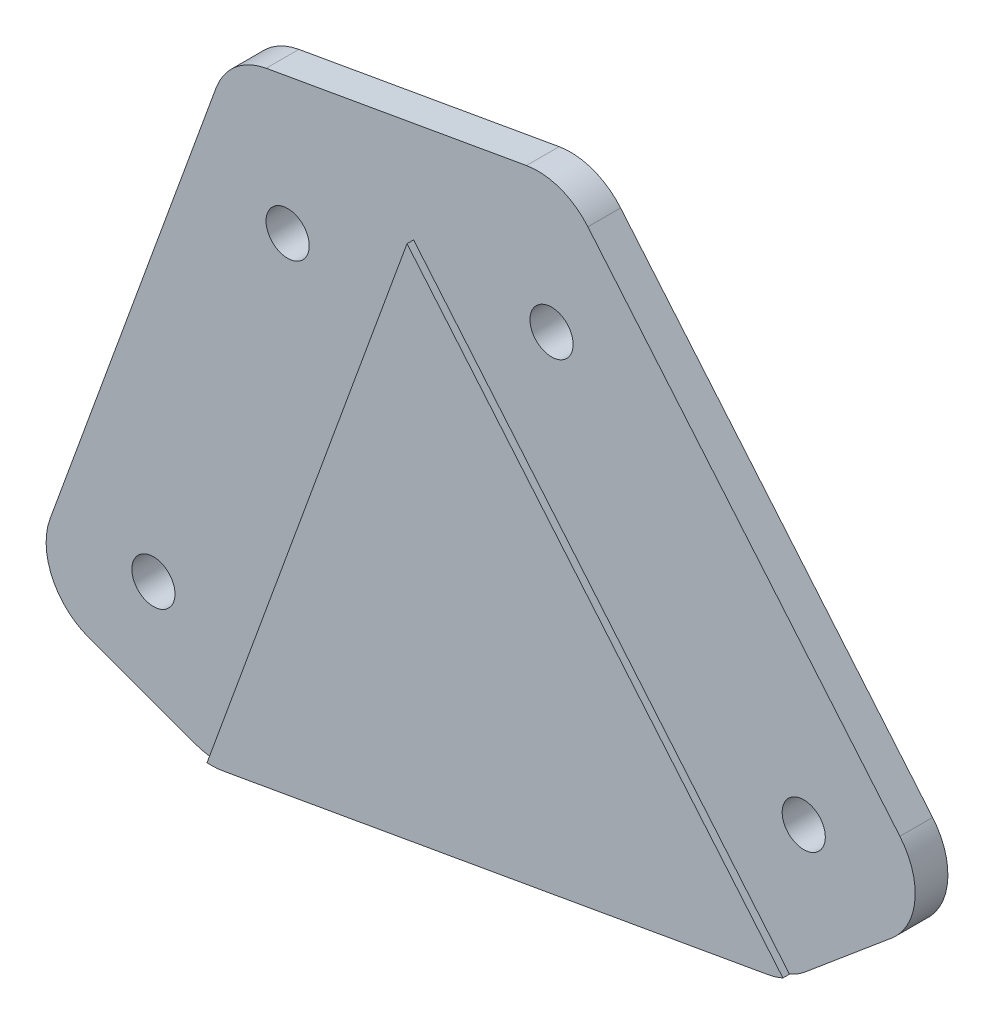
ISO-10303-21;
HEADER;
FILE_DESCRIPTION(('STEP AP214'),'2;1');
FILE_NAME('part.step','',(''),(''),'','','');
FILE_SCHEMA(('AUTOMOTIVE_DESIGN { 1 0 10303 214 1 1 1 1 }'));
ENDSEC;
DATA;
#1=APPLICATION_CONTEXT('core data for automotive mechanical design processes');
#2=APPLICATION_PROTOCOL_DEFINITION('international standard','automotive_design',2000,#1);
#3=PRODUCT_CONTEXT('',#1,'mechanical');
#4=PRODUCT('Part','Part','',(#3));
#5=PRODUCT_RELATED_PRODUCT_CATEGORY('part','',(#4));
#6=PRODUCT_DEFINITION_FORMATION('','',#4);
#7=PRODUCT_DEFINITION_CONTEXT('part definition',#1,'design');
#8=PRODUCT_DEFINITION('design','',#6,#7);
#9=PRODUCT_DEFINITION_SHAPE('','',#8);
#10=(LENGTH_UNIT() NAMED_UNIT(*) SI_UNIT(.MILLI.,.METRE.));
#11=(NAMED_UNIT(*) PLANE_ANGLE_UNIT() SI_UNIT($,.RADIAN.));
#12=(NAMED_UNIT(*) SI_UNIT($,.STERADIAN.) SOLID_ANGLE_UNIT());
#13=UNCERTAINTY_MEASURE_WITH_UNIT(LENGTH_MEASURE(1.E-05),#10,'distance_accuracy_value','');
#14=(GEOMETRIC_REPRESENTATION_CONTEXT(3) GLOBAL_UNCERTAINTY_ASSIGNED_CONTEXT((#13)) GLOBAL_UNIT_ASSIGNED_CONTEXT((#10,
#11,#12)) REPRESENTATION_CONTEXT('',''));
#15=CARTESIAN_POINT('',(0.,0.,0.));
#16=DIRECTION('',(0.,0.,1.));
#17=DIRECTION('',(1.,0.,0.));
#18=AXIS2_PLACEMENT_3D('',#15,#16,#17);
#19=CARTESIAN_POINT('',(269.693265733507,226.299519807984,3.));
#20=DIRECTION('',(-0.766044443118974,-0.642787609686544,0.));
#21=DIRECTION('',(0.642787609686544,-0.766044443118974,0.));
#22=AXIS2_PLACEMENT_3D('',#19,#20,#21);
#23=PLANE('',#22);
#24=DIRECTION('',(0.,0.,-1.));
#25=VECTOR('',#24,1.);
#26=CARTESIAN_POINT('',(146.461449044572,373.161480068931,3.));
#27=LINE('',#26,#25);
#28=CARTESIAN_POINT('',(146.461449044572,373.161480068931,0.));
#29=VERTEX_POINT('',#28);
#30=CARTESIAN_POINT('',(146.461449044572,373.161480068931,2.5));
#31=VERTEX_POINT('',#30);
#32=EDGE_CURVE('E258',#29,#31,#27,.F.);
#33=ORIENTED_EDGE('',*,*,#32,.T.);
#34=DIRECTION('',(-0.642787609686544,0.766044443118974,0.));
#35=VECTOR('',#34,1.);
#36=CARTESIAN_POINT('',(140.106367779345,380.735170997994,2.5));
#37=LINE('',#36,#35);
#38=CARTESIAN_POINT('',(170.317385434613,344.731082171402,2.5));
#39=VERTEX_POINT('',#38);
#40=EDGE_CURVE('E171',#39,#31,#37,.T.);
#41=ORIENTED_EDGE('',*,*,#40,.F.);
#42=DIRECTION('',(0.,0.,-1.));
#43=VECTOR('',#42,1.);
#44=CARTESIAN_POINT('',(170.317385434613,344.731082171402,3.));
#45=LINE('',#44,#43);
#46=CARTESIAN_POINT('',(170.317385434613,344.731082171402,0.));
#47=VERTEX_POINT('',#46);
#48=EDGE_CURVE('E256',#39,#47,#45,.T.);
#49=ORIENTED_EDGE('',*,*,#48,.T.);
#50=DIRECTION('',(-0.642787609686544,0.766044443118974,0.));
#51=VECTOR('',#50,1.);
#52=CARTESIAN_POINT('',(269.693265733507,226.299519807984,0.));
#53=LINE('',#52,#51);
#54=EDGE_CURVE('E212',#47,#29,#53,.T.);
#55=ORIENTED_EDGE('',*,*,#54,.T.);
#56=EDGE_LOOP('',(#33,#41,#49,#55));
#57=FACE_BOUND('',#56,.T.);
#58=ADVANCED_FACE('F44',(#57),#23,.F.);
#59=CARTESIAN_POINT('',(-59.8321388186772,339.324921111202,3.));
#60=DIRECTION('',(0.173648177666933,-0.984807753012208,0.));
#61=DIRECTION('',(0.984807753012208,0.173648177666933,0.));
#62=AXIS2_PLACEMENT_3D('',#59,#60,#61);
#63=PLANE('',#62);
#64=DIRECTION('',(0.,0.,-1.));
#65=VECTOR('',#64,1.);
#66=CARTESIAN_POINT('',(121.862720195086,371.36262701135,3.));
#67=LINE('',#66,#65);
#68=CARTESIAN_POINT('',(121.862720195086,371.36262701135,0.));
#69=VERTEX_POINT('',#68);
#70=CARTESIAN_POINT('',(121.862720195086,371.362627011349,2.5));
#71=VERTEX_POINT('',#70);
#72=EDGE_CURVE('E223',#69,#71,#67,.F.);
#73=ORIENTED_EDGE('',*,*,#72,.T.);
#74=DIRECTION('',(0.984807753012208,0.173648177666933,0.));
#75=VECTOR('',#74,1.);
#76=CARTESIAN_POINT('',(-59.8321388186772,339.324921111202,2.5));
#77=LINE('',#76,#75);
#78=CARTESIAN_POINT('',(141.762985940643,374.87158078556,2.5));
#79=VERTEX_POINT('',#78);
#80=EDGE_CURVE('E191',#71,#79,#77,.T.);
#81=ORIENTED_EDGE('',*,*,#80,.T.);
#82=DIRECTION('',(0.,0.,-1.));
#83=VECTOR('',#82,1.);
#84=CARTESIAN_POINT('',(141.762985940643,374.87158078556,3.));
#85=LINE('',#84,#83);
#86=CARTESIAN_POINT('',(141.762985940643,374.87158078556,0.));
#87=VERTEX_POINT('',#86);
#88=EDGE_CURVE('E242',#79,#87,#85,.T.);
#89=ORIENTED_EDGE('',*,*,#88,.T.);
#90=DIRECTION('',(-0.984807753012208,-0.173648177666933,0.));
#91=VECTOR('',#90,1.);
#92=CARTESIAN_POINT('',(-59.8321388186772,339.324921111202,0.));
#93=LINE('',#92,#91);
#94=EDGE_CURVE('E227',#87,#69,#93,.T.);
#95=ORIENTED_EDGE('',*,*,#94,.T.);
#96=EDGE_LOOP('',(#73,#81,#89,#95));
#97=FACE_BOUND('',#96,.T.);
#98=ADVANCED_FACE('F325',(#97),#63,.F.);
#99=CARTESIAN_POINT('',(-14.0953893117887,5.13030214988512,3.));
#100=DIRECTION('',(0.939692620785907,-0.342020143325673,0.));
#101=DIRECTION('',(0.342020143325673,0.939692620785907,0.));
#102=AXIS2_PLACEMENT_3D('',#99,#100,#101);
#103=PLANE('',#102);
#104=DIRECTION('',(0.,0.,-1.));
#105=VECTOR('',#104,1.);
#106=CARTESIAN_POINT('',(105.339019355551,333.273643069312,3.));
#107=LINE('',#106,#105);
#108=CARTESIAN_POINT('',(105.339019355551,333.273643069312,0.));
#109=VERTEX_POINT('',#108);
#110=CARTESIAN_POINT('',(105.339019355551,333.273643069312,2.5));
#111=VERTEX_POINT('',#110);
#112=EDGE_CURVE('E266',#109,#111,#107,.F.);
#113=ORIENTED_EDGE('',*,*,#112,.T.);
#114=DIRECTION('',(-0.342020143325673,-0.939692620785907,0.));
#115=VECTOR('',#114,1.);
#116=CARTESIAN_POINT('',(121.413966091858,377.439196246249,2.5));
#117=LINE('',#116,#115);
#118=CARTESIAN_POINT('',(118.032497979491,368.148688962917,2.5));
#119=VERTEX_POINT('',#118);
#120=EDGE_CURVE('E59',#119,#111,#117,.T.);
#121=ORIENTED_EDGE('',*,*,#120,.F.);
#122=DIRECTION('',(0.,0.,-1.));
#123=VECTOR('',#122,1.);
#124=CARTESIAN_POINT('',(118.032497979491,368.148688962917,3.));
#125=LINE('',#124,#123);
#126=CARTESIAN_POINT('',(118.032497979491,368.148688962917,0.));
#127=VERTEX_POINT('',#126);
#128=EDGE_CURVE('E269',#119,#127,#125,.T.);
#129=ORIENTED_EDGE('',*,*,#128,.T.);
#130=DIRECTION('',(-0.342020143325673,-0.939692620785907,0.));
#131=VECTOR('',#130,1.);
#132=CARTESIAN_POINT('',(-14.0953893117887,5.13030214988512,0.));
#133=LINE('',#132,#131);
#134=EDGE_CURVE('E230',#127,#109,#133,.T.);
#135=ORIENTED_EDGE('',*,*,#134,.T.);
#136=EDGE_LOOP('',(#113,#121,#129,#135));
#137=FACE_BOUND('',#136,.T.);
#138=ADVANCED_FACE('F333',(#137),#103,.F.);
#139=CARTESIAN_POINT('',(117.724307950708,323.444877815498,3.));
#140=DIRECTION('',(0.342020143325665,0.93969262078591,0.));
#141=DIRECTION('',(-0.93969262078591,0.342020143325665,0.));
#142=AXIS2_PLACEMENT_3D('',#139,#140,#141);
#143=PLANE('',#142);
#144=DIRECTION('',(0.,0.,-1.));
#145=VECTOR('',#144,1.);
#146=CARTESIAN_POINT('',(116.465358556346,323.903097921494,3.));
#147=LINE('',#146,#145);
#148=CARTESIAN_POINT('',(116.465358556346,323.903097921494,0.));
#149=VERTEX_POINT('',#148);
#150=CARTESIAN_POINT('',(116.465358556346,323.903097921493,2.5));
#151=VERTEX_POINT('',#150);
#152=EDGE_CURVE('E282',#149,#151,#147,.F.);
#153=ORIENTED_EDGE('',*,*,#152,.T.);
#154=DIRECTION('',(0.93969262078591,-0.342020143325665,0.));
#155=VECTOR('',#154,1.);
#156=CARTESIAN_POINT('',(103.628918638923,328.575179965382,2.5));
#157=LINE('',#156,#155);
#158=CARTESIAN_POINT('',(108.327381742852,326.865079248754,2.5));
#159=VERTEX_POINT('',#158);
#160=EDGE_CURVE('E162',#159,#151,#157,.T.);
#161=ORIENTED_EDGE('',*,*,#160,.F.);
#162=DIRECTION('',(0.,0.,-1.));
#163=VECTOR('',#162,1.);
#164=CARTESIAN_POINT('',(108.327381742852,326.865079248754,3.));
#165=LINE('',#164,#163);
#166=CARTESIAN_POINT('',(108.327381742852,326.865079248754,0.));
#167=VERTEX_POINT('',#166);
#168=EDGE_CURVE('E280',#159,#167,#165,.T.);
#169=ORIENTED_EDGE('',*,*,#168,.T.);
#170=DIRECTION('',(0.93969262078591,-0.342020143325665,0.));
#171=VECTOR('',#170,1.);
#172=CARTESIAN_POINT('',(117.724307950708,323.444877815498,0.));
#173=LINE('',#172,#171);
#174=EDGE_CURVE('E233',#167,#149,#173,.T.);
#175=ORIENTED_EDGE('',*,*,#174,.T.);
#176=EDGE_LOOP('',(#153,#161,#169,#175));
#177=FACE_BOUND('',#176,.T.);
#178=ADVANCED_FACE('F339',(#177),#143,.F.);
#179=CARTESIAN_POINT('',(-51.762509493055,293.559779025751,3.));
#180=DIRECTION('',(-0.173648177666931,0.984807753012208,0.));
#181=DIRECTION('',(-0.984807753012208,-0.173648177666931,0.));
#182=AXIS2_PLACEMENT_3D('',#179,#180,#181);
#183=PLANE('',#182);
#184=DIRECTION('',(0.984807753012208,0.173648177666931,0.));
#185=VECTOR('',#184,1.);
#186=CARTESIAN_POINT('',(-51.762509493055,293.559779025751,0.));
#187=LINE('',#186,#185);
#188=CARTESIAN_POINT('',(119.043700161309,323.677522260362,0.));
#189=VERTEX_POINT('',#188);
#190=CARTESIAN_POINT('',(160.721264625663,331.026401365644,0.));
#191=VERTEX_POINT('',#190);
#192=EDGE_CURVE('E236',#189,#191,#187,.T.);
#193=ORIENTED_EDGE('',*,*,#192,.T.);
#194=DIRECTION('',(0.,0.,-1.));
#195=VECTOR('',#194,1.);
#196=CARTESIAN_POINT('',(160.721264625663,331.026401365644,3.));
#197=LINE('',#196,#195);
#198=CARTESIAN_POINT('',(160.721264625663,331.026401365644,3.));
#199=VERTEX_POINT('',#198);
#200=EDGE_CURVE('E67',#191,#199,#197,.F.);
#201=ORIENTED_EDGE('',*,*,#200,.T.);
#202=DIRECTION('',(0.984807753012208,0.173648177666931,0.));
#203=VECTOR('',#202,1.);
#204=CARTESIAN_POINT('',(-51.762509493055,293.559779025751,3.));
#205=LINE('',#204,#203);
#206=CARTESIAN_POINT('',(119.043700161309,323.677522260362,3.));
#207=VERTEX_POINT('',#206);
#208=EDGE_CURVE('E221',#207,#199,#205,.T.);
#209=ORIENTED_EDGE('',*,*,#208,.F.);
#210=DIRECTION('',(0.,0.,-1.));
#211=VECTOR('',#210,1.);
#212=CARTESIAN_POINT('',(119.043700161309,323.677522260362,3.));
#213=LINE('',#212,#211);
#214=EDGE_CURVE('E276',#207,#189,#213,.T.);
#215=ORIENTED_EDGE('',*,*,#214,.T.);
#216=EDGE_LOOP('',(#193,#201,#209,#215));
#217=FACE_BOUND('',#216,.T.);
#218=ADVANCED_FACE('F294',(#217),#183,.F.);
#219=CARTESIAN_POINT('',(-96.1619422504614,114.601340147823,3.));
#220=DIRECTION('',(-0.642787609686543,0.766044443118975,0.));
#221=DIRECTION('',(-0.766044443118975,-0.642787609686543,0.));
#222=AXIS2_PLACEMENT_3D('',#219,#220,#221);
#223=PLANE('',#222);
#224=DIRECTION('',(0.,0.,-1.));
#225=VECTOR('',#224,1.);
#226=CARTESIAN_POINT('',(169.701101267451,337.686921907374,3.));
#227=LINE('',#226,#225);
#228=CARTESIAN_POINT('',(169.701101267451,337.686921907374,0.));
#229=VERTEX_POINT('',#228);
#230=CARTESIAN_POINT('',(169.701101267451,337.686921907374,2.5));
#231=VERTEX_POINT('',#230);
#232=EDGE_CURVE('E273',#229,#231,#227,.F.);
#233=ORIENTED_EDGE('',*,*,#232,.T.);
#234=DIRECTION('',(0.766044443118978,0.64278760968654,0.));
#235=VECTOR('',#234,1.);
#236=CARTESIAN_POINT('',(173.531323483046,340.900859955807,2.5));
#237=LINE('',#236,#235);
#238=CARTESIAN_POINT('',(163.066961785761,332.12021791511,2.5));
#239=VERTEX_POINT('',#238);
#240=EDGE_CURVE('E175',#239,#231,#237,.T.);
#241=ORIENTED_EDGE('',*,*,#240,.F.);
#242=DIRECTION('',(0.,0.,-1.));
#243=VECTOR('',#242,1.);
#244=CARTESIAN_POINT('',(163.066961785761,332.12021791511,3.));
#245=LINE('',#244,#243);
#246=CARTESIAN_POINT('',(163.066961785761,332.12021791511,0.));
#247=VERTEX_POINT('',#246);
#248=EDGE_CURVE('E271',#239,#247,#245,.T.);
#249=ORIENTED_EDGE('',*,*,#248,.T.);
#250=DIRECTION('',(0.766044443118975,0.642787609686543,0.));
#251=VECTOR('',#250,1.);
#252=CARTESIAN_POINT('',(-96.1619422504614,114.601340147823,0.));
#253=LINE('',#252,#251);
#254=EDGE_CURVE('E224',#247,#229,#253,.T.);
#255=ORIENTED_EDGE('',*,*,#254,.T.);
#256=EDGE_LOOP('',(#233,#241,#249,#255));
#257=FACE_BOUND('',#256,.T.);
#258=ADVANCED_FACE('F308',(#257),#223,.F.);
#259=CARTESIAN_POINT('',(0.,0.,3.));
#260=DIRECTION('',(0.,0.,1.));
#261=DIRECTION('',(1.,0.,0.));
#262=AXIS2_PLACEMENT_3D('',#259,#260,#261);
#263=PLANE('',#262);
#264=DIRECTION('',(0.64278760968654,-0.766044443118978,0.));
#265=VECTOR('',#264,1.);
#266=CARTESIAN_POINT('',(133.132579218133,365.632564975562,3.));
#267=LINE('',#266,#265);
#268=CARTESIAN_POINT('',(133.132579218133,365.632564975562,3.));
#269=VERTEX_POINT('',#268);
#270=CARTESIAN_POINT('',(161.875711881928,331.377833361072,3.));
#271=VERTEX_POINT('',#270);
#272=EDGE_CURVE('E182',#269,#271,#267,.T.);
#273=ORIENTED_EDGE('',*,*,#272,.F.);
#274=DIRECTION('',(0.342020143325664,0.93969262078591,0.));
#275=VECTOR('',#274,1.);
#276=CARTESIAN_POINT('',(133.132579218133,365.632564975562,3.));
#277=LINE('',#276,#275);
#278=CARTESIAN_POINT('',(117.838677772064,323.612916097124,3.));
#279=VERTEX_POINT('',#278);
#280=EDGE_CURVE('E168',#279,#269,#277,.T.);
#281=ORIENTED_EDGE('',*,*,#280,.F.);
#282=CARTESIAN_POINT('',(118.175459272974,328.601561025423,3.));
#283=DIRECTION('',(0.,0.,1.));
#284=DIRECTION('',(1.,0.,0.));
#285=AXIS2_PLACEMENT_3D('',#282,#283,#284);
#286=CIRCLE('',#285,5.);
#287=EDGE_CURVE('E261',#279,#207,#286,.T.);
#288=ORIENTED_EDGE('',*,*,#287,.T.);
#289=ORIENTED_EDGE('',*,*,#208,.T.);
#290=CARTESIAN_POINT('',(159.853023737329,335.950440130705,3.));
#291=DIRECTION('',(0.,0.,1.));
#292=DIRECTION('',(1.,0.,0.));
#293=AXIS2_PLACEMENT_3D('',#290,#291,#292);
#294=CIRCLE('',#293,5.);
#295=EDGE_CURVE('E263',#199,#271,#294,.T.);
#296=ORIENTED_EDGE('',*,*,#295,.T.);
#297=EDGE_LOOP('',(#273,#281,#288,#289,#296));
#298=FACE_BOUND('',#297,.T.);
#299=ADVANCED_FACE('F289',(#298),#263,.T.);
#300=CARTESIAN_POINT('',(0.,0.,0.));
#301=DIRECTION('',(0.,0.,1.));
#302=DIRECTION('',(1.,0.,0.));
#303=AXIS2_PLACEMENT_3D('',#300,#301,#302);
#304=PLANE('',#303);
#305=CARTESIAN_POINT('',(113.241764369759,333.057723546334,0.));
#306=DIRECTION('',(0.,0.,1.));
#307=DIRECTION('',(1.,0.,0.));
#308=AXIS2_PLACEMENT_3D('',#305,#306,#307);
#309=CIRCLE('',#308,1.65000000000002);
#310=CARTESIAN_POINT('',(114.891764369759,333.057723546334,0.));
#311=VERTEX_POINT('',#310);
#312=EDGE_CURVE('E209',#311,#311,#309,.T.);
#313=ORIENTED_EDGE('',*,*,#312,.T.);
#314=EDGE_LOOP('',(#313));
#315=FACE_BOUND('',#314,.T.);
#316=CARTESIAN_POINT('',(123.50236866953,361.248502169911,0.));
#317=DIRECTION('',(0.,0.,1.));
#318=DIRECTION('',(1.,0.,0.));
#319=AXIS2_PLACEMENT_3D('',#316,#317,#318);
#320=CIRCLE('',#319,1.65000000000002);
#321=CARTESIAN_POINT('',(125.15236866953,361.248502169911,0.));
#322=VERTEX_POINT('',#321);
#323=EDGE_CURVE('E213',#322,#322,#320,.T.);
#324=ORIENTED_EDGE('',*,*,#323,.T.);
#325=EDGE_LOOP('',(#324));
#326=FACE_BOUND('',#325,.T.);
#327=CARTESIAN_POINT('',(143.681454796408,364.80661950012,0.));
#328=DIRECTION('',(0.,0.,1.));
#329=DIRECTION('',(1.,0.,0.));
#330=AXIS2_PLACEMENT_3D('',#327,#328,#329);
#331=CIRCLE('',#330,1.65000000000002);
#332=CARTESIAN_POINT('',(145.331454796408,364.80661950012,0.));
#333=VERTEX_POINT('',#332);
#334=EDGE_CURVE('E216',#333,#333,#331,.T.);
#335=ORIENTED_EDGE('',*,*,#334,.T.);
#336=EDGE_LOOP('',(#335));
#337=FACE_BOUND('',#336,.T.);
#338=CARTESIAN_POINT('',(162.965083087004,341.825286206551,0.));
#339=DIRECTION('',(0.,0.,1.));
#340=DIRECTION('',(1.,0.,0.));
#341=AXIS2_PLACEMENT_3D('',#338,#339,#340);
#342=CIRCLE('',#341,1.65000000000002);
#343=CARTESIAN_POINT('',(164.615083087004,341.825286206551,0.));
#344=VERTEX_POINT('',#343);
#345=EDGE_CURVE('E208',#344,#344,#342,.T.);
#346=ORIENTED_EDGE('',*,*,#345,.T.);
#347=EDGE_LOOP('',(#346));
#348=FACE_BOUND('',#347,.T.);
#349=ORIENTED_EDGE('',*,*,#94,.F.);
#350=CARTESIAN_POINT('',(142.631226828978,369.947542020499,0.));
#351=DIRECTION('',(0.,0.,1.));
#352=DIRECTION('',(1.,0.,0.));
#353=AXIS2_PLACEMENT_3D('',#350,#351,#352);
#354=CIRCLE('',#353,5.);
#355=EDGE_CURVE('E254',#87,#29,#354,.F.);
#356=ORIENTED_EDGE('',*,*,#355,.T.);
#357=ORIENTED_EDGE('',*,*,#54,.F.);
#358=CARTESIAN_POINT('',(166.487163219018,341.517144122969,0.));
#359=DIRECTION('',(0.,0.,1.));
#360=DIRECTION('',(1.,0.,0.));
#361=AXIS2_PLACEMENT_3D('',#358,#359,#360);
#362=CIRCLE('',#361,5.);
#363=EDGE_CURVE('E250',#47,#229,#362,.F.);
#364=ORIENTED_EDGE('',*,*,#363,.T.);
#365=ORIENTED_EDGE('',*,*,#254,.F.);
#366=CARTESIAN_POINT('',(159.853023737329,335.950440130705,0.));
#367=DIRECTION('',(0.,0.,1.));
#368=DIRECTION('',(1.,0.,0.));
#369=AXIS2_PLACEMENT_3D('',#366,#367,#368);
#370=CIRCLE('',#369,5.);
#371=EDGE_CURVE('E248',#247,#191,#370,.F.);
#372=ORIENTED_EDGE('',*,*,#371,.T.);
#373=ORIENTED_EDGE('',*,*,#192,.F.);
#374=CARTESIAN_POINT('',(118.175459272974,328.601561025423,0.));
#375=DIRECTION('',(0.,0.,1.));
#376=DIRECTION('',(1.,0.,0.));
#377=AXIS2_PLACEMENT_3D('',#374,#375,#376);
#378=CIRCLE('',#377,5.);
#379=EDGE_CURVE('E246',#189,#149,#378,.F.);
#380=ORIENTED_EDGE('',*,*,#379,.T.);
#381=ORIENTED_EDGE('',*,*,#174,.F.);
#382=CARTESIAN_POINT('',(110.03748245948,331.563542352683,0.));
#383=DIRECTION('',(0.,0.,1.));
#384=DIRECTION('',(1.,0.,0.));
#385=AXIS2_PLACEMENT_3D('',#382,#383,#384);
#386=CIRCLE('',#385,5.);
#387=EDGE_CURVE('E244',#167,#109,#386,.F.);
#388=ORIENTED_EDGE('',*,*,#387,.T.);
#389=ORIENTED_EDGE('',*,*,#134,.F.);
#390=CARTESIAN_POINT('',(122.730961083421,366.438588246288,0.));
#391=DIRECTION('',(0.,0.,1.));
#392=DIRECTION('',(1.,0.,0.));
#393=AXIS2_PLACEMENT_3D('',#390,#391,#392);
#394=CIRCLE('',#393,5.);
#395=EDGE_CURVE('E252',#127,#69,#394,.F.);
#396=ORIENTED_EDGE('',*,*,#395,.T.);
#397=EDGE_LOOP('',(#349,#356,#357,#364,#365,#372,#373,#380,#381,#388,#389,#396));
#398=FACE_BOUND('',#397,.T.);
#399=ADVANCED_FACE('F297',(#315,#326,#337,#348,#398),#304,.F.);
#400=CARTESIAN_POINT('',(162.965083087004,341.825286206551,0.));
#401=DIRECTION('',(0.,0.,1.));
#402=DIRECTION('',(1.,0.,0.));
#403=AXIS2_PLACEMENT_3D('',#400,#401,#402);
#404=CYLINDRICAL_SURFACE('',#403,1.65000000000002);
#405=CARTESIAN_POINT('',(162.965083087004,341.825286206551,2.5));
#406=DIRECTION('',(0.,0.,-1.));
#407=DIRECTION('',(-1.,0.,0.));
#408=AXIS2_PLACEMENT_3D('',#405,#406,#407);
#409=CIRCLE('',#408,1.65000000000002);
#410=CARTESIAN_POINT('',(161.315083087004,341.825286206551,2.5));
#411=VERTEX_POINT('',#410);
#412=EDGE_CURVE('E205',#411,#411,#409,.F.);
#413=ORIENTED_EDGE('',*,*,#412,.T.);
#414=EDGE_LOOP('',(#413));
#415=FACE_BOUND('',#414,.T.);
#416=ORIENTED_EDGE('',*,*,#345,.F.);
#417=EDGE_LOOP('',(#416));
#418=FACE_BOUND('',#417,.T.);
#419=ADVANCED_FACE('F416',(#415,#418),#404,.F.);
#420=CARTESIAN_POINT('',(143.681454796408,364.80661950012,0.));
#421=DIRECTION('',(0.,0.,1.));
#422=DIRECTION('',(1.,0.,0.));
#423=AXIS2_PLACEMENT_3D('',#420,#421,#422);
#424=CYLINDRICAL_SURFACE('',#423,1.65000000000002);
#425=CARTESIAN_POINT('',(143.681454796408,364.80661950012,2.5));
#426=DIRECTION('',(0.,0.,-1.));
#427=DIRECTION('',(-1.,0.,0.));
#428=AXIS2_PLACEMENT_3D('',#425,#426,#427);
#429=CIRCLE('',#428,1.65000000000002);
#430=CARTESIAN_POINT('',(142.031454796408,364.80661950012,2.5));
#431=VERTEX_POINT('',#430);
#432=EDGE_CURVE('E202',#431,#431,#429,.F.);
#433=ORIENTED_EDGE('',*,*,#432,.T.);
#434=EDGE_LOOP('',(#433));
#435=FACE_BOUND('',#434,.T.);
#436=ORIENTED_EDGE('',*,*,#334,.F.);
#437=EDGE_LOOP('',(#436));
#438=FACE_BOUND('',#437,.T.);
#439=ADVANCED_FACE('F412',(#435,#438),#424,.F.);
#440=CARTESIAN_POINT('',(123.50236866953,361.248502169911,0.));
#441=DIRECTION('',(0.,0.,1.));
#442=DIRECTION('',(1.,0.,0.));
#443=AXIS2_PLACEMENT_3D('',#440,#441,#442);
#444=CYLINDRICAL_SURFACE('',#443,1.65000000000002);
#445=CARTESIAN_POINT('',(123.50236866953,361.248502169911,2.5));
#446=DIRECTION('',(0.,0.,-1.));
#447=DIRECTION('',(-1.,0.,0.));
#448=AXIS2_PLACEMENT_3D('',#445,#446,#447);
#449=CIRCLE('',#448,1.65000000000002);
#450=CARTESIAN_POINT('',(121.85236866953,361.248502169911,2.5));
#451=VERTEX_POINT('',#450);
#452=EDGE_CURVE('E199',#451,#451,#449,.F.);
#453=ORIENTED_EDGE('',*,*,#452,.T.);
#454=EDGE_LOOP('',(#453));
#455=FACE_BOUND('',#454,.T.);
#456=ORIENTED_EDGE('',*,*,#323,.F.);
#457=EDGE_LOOP('',(#456));
#458=FACE_BOUND('',#457,.T.);
#459=ADVANCED_FACE('F408',(#455,#458),#444,.F.);
#460=CARTESIAN_POINT('',(113.241764369759,333.057723546334,0.));
#461=DIRECTION('',(0.,0.,1.));
#462=DIRECTION('',(1.,0.,0.));
#463=AXIS2_PLACEMENT_3D('',#460,#461,#462);
#464=CYLINDRICAL_SURFACE('',#463,1.65000000000002);
#465=CARTESIAN_POINT('',(113.241764369759,333.057723546334,2.5));
#466=DIRECTION('',(0.,0.,-1.));
#467=DIRECTION('',(-1.,0.,0.));
#468=AXIS2_PLACEMENT_3D('',#465,#466,#467);
#469=CIRCLE('',#468,1.65000000000002);
#470=CARTESIAN_POINT('',(111.591764369759,333.057723546334,2.5));
#471=VERTEX_POINT('',#470);
#472=EDGE_CURVE('E196',#471,#471,#469,.F.);
#473=ORIENTED_EDGE('',*,*,#472,.T.);
#474=EDGE_LOOP('',(#473));
#475=FACE_BOUND('',#474,.T.);
#476=ORIENTED_EDGE('',*,*,#312,.F.);
#477=EDGE_LOOP('',(#476));
#478=FACE_BOUND('',#477,.T.);
#479=ADVANCED_FACE('F360',(#475,#478),#464,.F.);
#480=CARTESIAN_POINT('',(142.631226828978,369.947542020499,3.));
#481=DIRECTION('',(0.,0.,-1.));
#482=DIRECTION('',(-1.,0.,0.));
#483=AXIS2_PLACEMENT_3D('',#480,#481,#482);
#484=CYLINDRICAL_SURFACE('',#483,5.);
#485=CARTESIAN_POINT('',(142.631226828978,369.947542020499,2.5));
#486=DIRECTION('',(0.,0.,-1.));
#487=DIRECTION('',(-1.,0.,0.));
#488=AXIS2_PLACEMENT_3D('',#485,#486,#487);
#489=CIRCLE('',#488,5.);
#490=EDGE_CURVE('E194',#31,#79,#489,.F.);
#491=ORIENTED_EDGE('',*,*,#490,.F.);
#492=ORIENTED_EDGE('',*,*,#32,.F.);
#493=ORIENTED_EDGE('',*,*,#355,.F.);
#494=ORIENTED_EDGE('',*,*,#88,.F.);
#495=EDGE_LOOP('',(#491,#492,#493,#494));
#496=FACE_BOUND('',#495,.T.);
#497=ADVANCED_FACE('F321',(#496),#484,.T.);
#498=CARTESIAN_POINT('',(122.730961083421,366.438588246288,3.));
#499=DIRECTION('',(0.,0.,-1.));
#500=DIRECTION('',(-1.,0.,0.));
#501=AXIS2_PLACEMENT_3D('',#498,#499,#500);
#502=CYLINDRICAL_SURFACE('',#501,5.);
#503=CARTESIAN_POINT('',(122.730961083421,366.438588246288,2.5));
#504=DIRECTION('',(0.,0.,-1.));
#505=DIRECTION('',(-1.,0.,0.));
#506=AXIS2_PLACEMENT_3D('',#503,#504,#505);
#507=CIRCLE('',#506,5.);
#508=EDGE_CURVE('E189',#71,#119,#507,.F.);
#509=ORIENTED_EDGE('',*,*,#508,.F.);
#510=ORIENTED_EDGE('',*,*,#72,.F.);
#511=ORIENTED_EDGE('',*,*,#395,.F.);
#512=ORIENTED_EDGE('',*,*,#128,.F.);
#513=EDGE_LOOP('',(#509,#510,#511,#512));
#514=FACE_BOUND('',#513,.T.);
#515=ADVANCED_FACE('F329',(#514),#502,.T.);
#516=CARTESIAN_POINT('',(166.487163219018,341.517144122969,3.));
#517=DIRECTION('',(0.,0.,-1.));
#518=DIRECTION('',(-1.,0.,0.));
#519=AXIS2_PLACEMENT_3D('',#516,#517,#518);
#520=CYLINDRICAL_SURFACE('',#519,5.);
#521=CARTESIAN_POINT('',(166.487163219018,341.517144122969,2.5));
#522=DIRECTION('',(0.,0.,-1.));
#523=DIRECTION('',(-1.,0.,0.));
#524=AXIS2_PLACEMENT_3D('',#521,#522,#523);
#525=CIRCLE('',#524,5.);
#526=EDGE_CURVE('E187',#231,#39,#525,.F.);
#527=ORIENTED_EDGE('',*,*,#526,.F.);
#528=ORIENTED_EDGE('',*,*,#232,.F.);
#529=ORIENTED_EDGE('',*,*,#363,.F.);
#530=ORIENTED_EDGE('',*,*,#48,.F.);
#531=EDGE_LOOP('',(#527,#528,#529,#530));
#532=FACE_BOUND('',#531,.T.);
#533=ADVANCED_FACE('F312',(#532),#520,.T.);
#534=CARTESIAN_POINT('',(159.853023737329,335.950440130705,3.));
#535=DIRECTION('',(0.,0.,-1.));
#536=DIRECTION('',(-1.,0.,0.));
#537=AXIS2_PLACEMENT_3D('',#534,#535,#536);
#538=CYLINDRICAL_SURFACE('',#537,5.);
#539=DIRECTION('',(0.,0.,-1.));
#540=VECTOR('',#539,1.);
#541=CARTESIAN_POINT('',(161.875711881928,331.377833361072,3.));
#542=LINE('',#541,#540);
#543=CARTESIAN_POINT('',(161.875711881928,331.377833361072,2.5));
#544=VERTEX_POINT('',#543);
#545=EDGE_CURVE('E12',#271,#544,#542,.T.);
#546=ORIENTED_EDGE('',*,*,#545,.F.);
#547=ORIENTED_EDGE('',*,*,#295,.F.);
#548=ORIENTED_EDGE('',*,*,#200,.F.);
#549=ORIENTED_EDGE('',*,*,#371,.F.);
#550=ORIENTED_EDGE('',*,*,#248,.F.);
#551=CARTESIAN_POINT('',(159.853023737329,335.950440130705,2.5));
#552=DIRECTION('',(0.,0.,-1.));
#553=DIRECTION('',(-1.,0.,0.));
#554=AXIS2_PLACEMENT_3D('',#551,#552,#553);
#555=CIRCLE('',#554,5.);
#556=EDGE_CURVE('E185',#544,#239,#555,.F.);
#557=ORIENTED_EDGE('',*,*,#556,.F.);
#558=EDGE_LOOP('',(#546,#547,#548,#549,#550,#557));
#559=FACE_BOUND('',#558,.T.);
#560=ADVANCED_FACE('F303',(#559),#538,.T.);
#561=CARTESIAN_POINT('',(118.175459272974,328.601561025423,3.));
#562=DIRECTION('',(0.,0.,-1.));
#563=DIRECTION('',(-1.,0.,0.));
#564=AXIS2_PLACEMENT_3D('',#561,#562,#563);
#565=CYLINDRICAL_SURFACE('',#564,5.);
#566=DIRECTION('',(0.,0.,-1.));
#567=VECTOR('',#566,1.);
#568=CARTESIAN_POINT('',(117.838677772064,323.612916097124,3.));
#569=LINE('',#568,#567);
#570=CARTESIAN_POINT('',(117.838677772064,323.612916097124,2.5));
#571=VERTEX_POINT('',#570);
#572=EDGE_CURVE('E52',#571,#279,#569,.F.);
#573=ORIENTED_EDGE('',*,*,#572,.F.);
#574=CARTESIAN_POINT('',(118.175459272974,328.601561025423,2.5));
#575=DIRECTION('',(0.,0.,-1.));
#576=DIRECTION('',(-1.,0.,0.));
#577=AXIS2_PLACEMENT_3D('',#574,#575,#576);
#578=CIRCLE('',#577,5.);
#579=EDGE_CURVE('E159',#151,#571,#578,.F.);
#580=ORIENTED_EDGE('',*,*,#579,.F.);
#581=ORIENTED_EDGE('',*,*,#152,.F.);
#582=ORIENTED_EDGE('',*,*,#379,.F.);
#583=ORIENTED_EDGE('',*,*,#214,.F.);
#584=ORIENTED_EDGE('',*,*,#287,.F.);
#585=EDGE_LOOP('',(#573,#580,#581,#582,#583,#584));
#586=FACE_BOUND('',#585,.T.);
#587=ADVANCED_FACE('F291',(#586),#565,.T.);
#588=CARTESIAN_POINT('',(110.03748245948,331.563542352683,3.));
#589=DIRECTION('',(0.,0.,-1.));
#590=DIRECTION('',(-1.,0.,0.));
#591=AXIS2_PLACEMENT_3D('',#588,#589,#590);
#592=CYLINDRICAL_SURFACE('',#591,5.);
#593=CARTESIAN_POINT('',(110.03748245948,331.563542352683,2.5));
#594=DIRECTION('',(0.,0.,-1.));
#595=DIRECTION('',(-1.,0.,0.));
#596=AXIS2_PLACEMENT_3D('',#593,#594,#595);
#597=CIRCLE('',#596,5.);
#598=EDGE_CURVE('E285',#111,#159,#597,.F.);
#599=ORIENTED_EDGE('',*,*,#598,.F.);
#600=ORIENTED_EDGE('',*,*,#112,.F.);
#601=ORIENTED_EDGE('',*,*,#387,.F.);
#602=ORIENTED_EDGE('',*,*,#168,.F.);
#603=EDGE_LOOP('',(#599,#600,#601,#602));
#604=FACE_BOUND('',#603,.T.);
#605=ADVANCED_FACE('F46',(#604),#592,.T.);
#606=CARTESIAN_POINT('',(0.,0.,2.5));
#607=DIRECTION('',(0.,0.,-1.));
#608=DIRECTION('',(-1.,0.,0.));
#609=AXIS2_PLACEMENT_3D('',#606,#607,#608);
#610=PLANE('',#609);
#611=ORIENTED_EDGE('',*,*,#432,.F.);
#612=EDGE_LOOP('',(#611));
#613=FACE_BOUND('',#612,.T.);
#614=ORIENTED_EDGE('',*,*,#472,.F.);
#615=EDGE_LOOP('',(#614));
#616=FACE_BOUND('',#615,.T.);
#617=ORIENTED_EDGE('',*,*,#490,.T.);
#618=ORIENTED_EDGE('',*,*,#80,.F.);
#619=ORIENTED_EDGE('',*,*,#508,.T.);
#620=ORIENTED_EDGE('',*,*,#120,.T.);
#621=ORIENTED_EDGE('',*,*,#598,.T.);
#622=ORIENTED_EDGE('',*,*,#160,.T.);
#623=ORIENTED_EDGE('',*,*,#579,.T.);
#624=DIRECTION('',(0.342020143325664,0.93969262078591,0.));
#625=VECTOR('',#624,1.);
#626=CARTESIAN_POINT('',(133.132579218133,365.632564975562,2.5));
#627=LINE('',#626,#625);
#628=CARTESIAN_POINT('',(133.132579218133,365.632564975562,2.5));
#629=VERTEX_POINT('',#628);
#630=EDGE_CURVE('E151',#571,#629,#627,.T.);
#631=ORIENTED_EDGE('',*,*,#630,.T.);
#632=DIRECTION('',(0.64278760968654,-0.766044443118978,0.));
#633=VECTOR('',#632,1.);
#634=CARTESIAN_POINT('',(133.132579218133,365.632564975562,2.5));
#635=LINE('',#634,#633);
#636=EDGE_CURVE('E156',#629,#544,#635,.T.);
#637=ORIENTED_EDGE('',*,*,#636,.T.);
#638=ORIENTED_EDGE('',*,*,#556,.T.);
#639=ORIENTED_EDGE('',*,*,#240,.T.);
#640=ORIENTED_EDGE('',*,*,#526,.T.);
#641=ORIENTED_EDGE('',*,*,#40,.T.);
#642=EDGE_LOOP('',(#617,#618,#619,#620,#621,#622,#623,#631,#637,#638,#639,#640,#641));
#643=FACE_BOUND('',#642,.T.);
#644=ORIENTED_EDGE('',*,*,#452,.F.);
#645=EDGE_LOOP('',(#644));
#646=FACE_BOUND('',#645,.T.);
#647=ORIENTED_EDGE('',*,*,#412,.F.);
#648=EDGE_LOOP('',(#647));
#649=FACE_BOUND('',#648,.T.);
#650=ADVANCED_FACE('F153',(#613,#616,#643,#646,#649),#610,.F.);
#651=CARTESIAN_POINT('',(133.132579218133,365.632564975562,2.5));
#652=DIRECTION('',(-0.766044443118978,-0.64278760968654,0.));
#653=DIRECTION('',(0.64278760968654,-0.766044443118978,0.));
#654=AXIS2_PLACEMENT_3D('',#651,#652,#653);
#655=PLANE('',#654);
#656=ORIENTED_EDGE('',*,*,#545,.T.);
#657=ORIENTED_EDGE('',*,*,#636,.F.);
#658=DIRECTION('',(0.,0.,1.));
#659=VECTOR('',#658,1.);
#660=CARTESIAN_POINT('',(133.132579218133,365.632564975562,2.5));
#661=LINE('',#660,#659);
#662=EDGE_CURVE('E165',#629,#269,#661,.T.);
#663=ORIENTED_EDGE('',*,*,#662,.T.);
#664=ORIENTED_EDGE('',*,*,#272,.T.);
#665=EDGE_LOOP('',(#656,#657,#663,#664));
#666=FACE_BOUND('',#665,.T.);
#667=ADVANCED_FACE('F173',(#666),#655,.F.);
#668=CARTESIAN_POINT('',(133.132579218133,365.632564975562,2.5));
#669=DIRECTION('',(0.93969262078591,-0.342020143325664,0.));
#670=DIRECTION('',(0.342020143325664,0.93969262078591,0.));
#671=AXIS2_PLACEMENT_3D('',#668,#669,#670);
#672=PLANE('',#671);
#673=ORIENTED_EDGE('',*,*,#572,.T.);
#674=ORIENTED_EDGE('',*,*,#280,.T.);
#675=ORIENTED_EDGE('',*,*,#662,.F.);
#676=ORIENTED_EDGE('',*,*,#630,.F.);
#677=EDGE_LOOP('',(#673,#674,#675,#676));
#678=FACE_BOUND('',#677,.T.);
#679=ADVANCED_FACE('F166',(#678),#672,.F.);
#680=CLOSED_SHELL('',(#58,#98,#138,#178,#218,#258,#299,#399,#419,#439,#459,#479,#497,#515,#533,
#560,#587,#605,#650,#667,#679));
#681=MANIFOLD_SOLID_BREP('B2',#680);
#682=ADVANCED_BREP_SHAPE_REPRESENTATION('',(#18,#681),#14);
#683=SHAPE_DEFINITION_REPRESENTATION(#9,#682);
ENDSEC;
END-ISO-10303-21;
